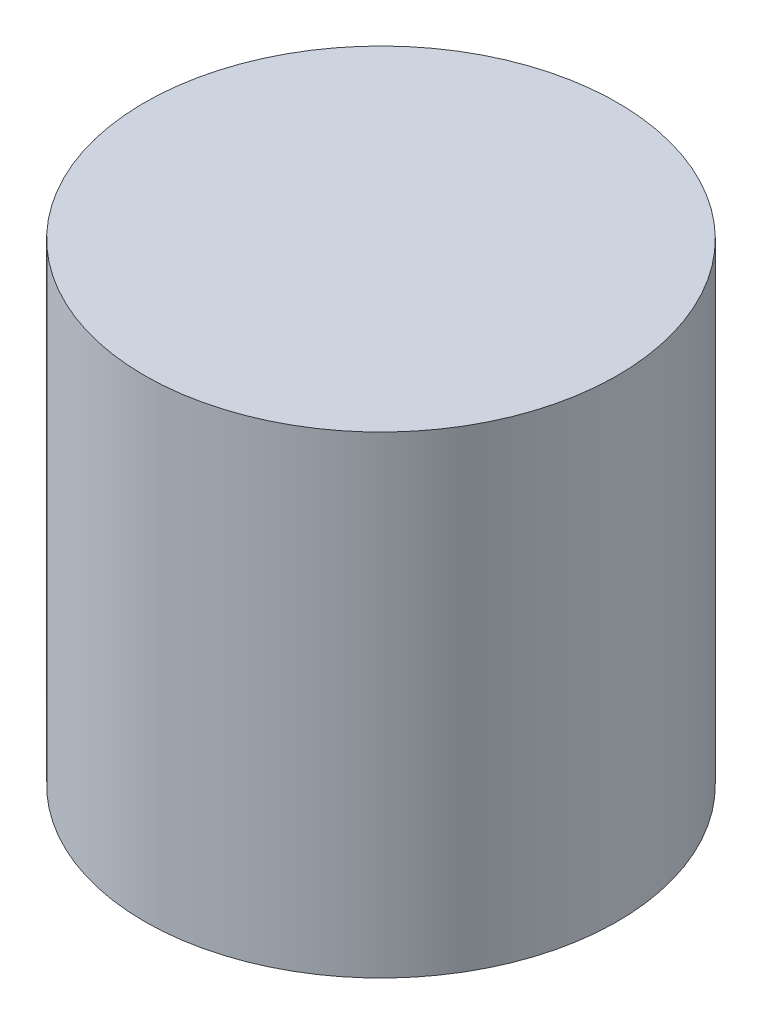
ISO-10303-21;
HEADER;
FILE_DESCRIPTION(('STEP AP214'),'2;1');
FILE_NAME('part.step','',(''),(''),'','','');
FILE_SCHEMA(('AUTOMOTIVE_DESIGN { 1 0 10303 214 1 1 1 1 }'));
ENDSEC;
DATA;
#1=APPLICATION_CONTEXT('core data for automotive mechanical design processes');
#2=APPLICATION_PROTOCOL_DEFINITION('international standard','automotive_design',2000,#1);
#3=PRODUCT_CONTEXT('',#1,'mechanical');
#4=PRODUCT('Part','Part','',(#3));
#5=PRODUCT_RELATED_PRODUCT_CATEGORY('part','',(#4));
#6=PRODUCT_DEFINITION_FORMATION('','',#4);
#7=PRODUCT_DEFINITION_CONTEXT('part definition',#1,'design');
#8=PRODUCT_DEFINITION('design','',#6,#7);
#9=PRODUCT_DEFINITION_SHAPE('','',#8);
#10=(LENGTH_UNIT() NAMED_UNIT(*) SI_UNIT(.MILLI.,.METRE.));
#11=(NAMED_UNIT(*) PLANE_ANGLE_UNIT() SI_UNIT($,.RADIAN.));
#12=(NAMED_UNIT(*) SI_UNIT($,.STERADIAN.) SOLID_ANGLE_UNIT());
#13=UNCERTAINTY_MEASURE_WITH_UNIT(LENGTH_MEASURE(1.E-05),#10,'distance_accuracy_value','');
#14=(GEOMETRIC_REPRESENTATION_CONTEXT(3) GLOBAL_UNCERTAINTY_ASSIGNED_CONTEXT((#13)) GLOBAL_UNIT_ASSIGNED_CONTEXT((#10,
#11,#12)) REPRESENTATION_CONTEXT('',''));
#15=CARTESIAN_POINT('',(0.,0.,0.));
#16=DIRECTION('',(0.,0.,1.));
#17=DIRECTION('',(1.,0.,0.));
#18=AXIS2_PLACEMENT_3D('',#15,#16,#17);
#19=CARTESIAN_POINT('',(0.,2.38125,0.));
#20=DIRECTION('',(0.,-1.,0.));
#21=DIRECTION('',(0.,0.,-1.));
#22=AXIS2_PLACEMENT_3D('',#19,#20,#21);
#23=CYLINDRICAL_SURFACE('',#22,2.38125);
#24=CARTESIAN_POINT('',(0.,2.38125,0.));
#25=DIRECTION('',(0.,1.,0.));
#26=DIRECTION('',(0.,0.,1.));
#27=AXIS2_PLACEMENT_3D('',#24,#25,#26);
#28=CIRCLE('',#27,2.38125);
#29=CARTESIAN_POINT('',(0.,2.38125,2.38125));
#30=VERTEX_POINT('',#29);
#31=EDGE_CURVE('E10',#30,#30,#28,.T.);
#32=ORIENTED_EDGE('',*,*,#31,.F.);
#33=EDGE_LOOP('',(#32));
#34=FACE_BOUND('',#33,.T.);
#35=CARTESIAN_POINT('',(0.,-2.38125,0.));
#36=DIRECTION('',(0.,1.,0.));
#37=DIRECTION('',(0.,0.,1.));
#38=AXIS2_PLACEMENT_3D('',#35,#36,#37);
#39=CIRCLE('',#38,2.38125);
#40=CARTESIAN_POINT('',(0.,-2.38125,2.38125));
#41=VERTEX_POINT('',#40);
#42=EDGE_CURVE('E34',#41,#41,#39,.T.);
#43=ORIENTED_EDGE('',*,*,#42,.T.);
#44=EDGE_LOOP('',(#43));
#45=FACE_BOUND('',#44,.T.);
#46=ADVANCED_FACE('F31',(#34,#45),#23,.T.);
#47=CARTESIAN_POINT('',(0.,2.38125,0.));
#48=DIRECTION('',(0.,1.,0.));
#49=DIRECTION('',(0.,0.,1.));
#50=AXIS2_PLACEMENT_3D('',#47,#48,#49);
#51=PLANE('',#50);
#52=ORIENTED_EDGE('',*,*,#31,.T.);
#53=EDGE_LOOP('',(#52));
#54=FACE_BOUND('',#53,.T.);
#55=ADVANCED_FACE('F46',(#54),#51,.T.);
#56=CARTESIAN_POINT('',(0.,-2.38125,0.));
#57=DIRECTION('',(0.,1.,0.));
#58=DIRECTION('',(0.,0.,1.));
#59=AXIS2_PLACEMENT_3D('',#56,#57,#58);
#60=PLANE('',#59);
#61=ORIENTED_EDGE('',*,*,#42,.F.);
#62=EDGE_LOOP('',(#61));
#63=FACE_BOUND('',#62,.T.);
#64=ADVANCED_FACE('F44',(#63),#60,.F.);
#65=CLOSED_SHELL('',(#46,#55,#64));
#66=MANIFOLD_SOLID_BREP('B2',#65);
#67=ADVANCED_BREP_SHAPE_REPRESENTATION('',(#18,#66),#14);
#68=SHAPE_DEFINITION_REPRESENTATION(#9,#67);
ENDSEC;
END-ISO-10303-21;
